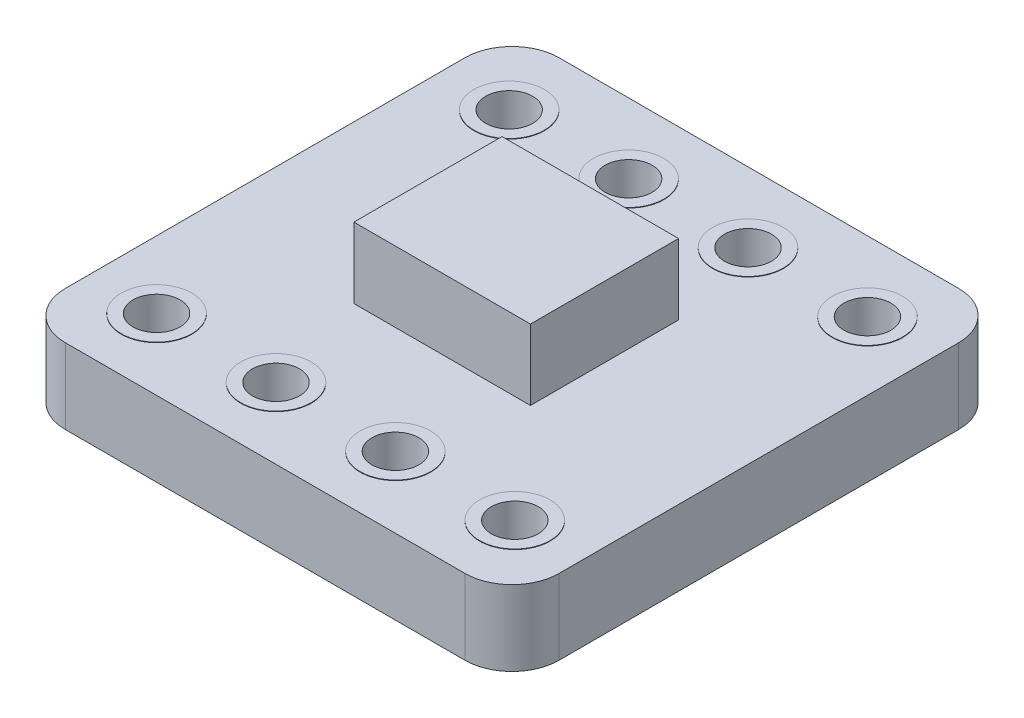
ISO-10303-21;
HEADER;
FILE_DESCRIPTION(('STEP AP214'),'2;1');
FILE_NAME('part.step','',(''),(''),'','','');
FILE_SCHEMA(('AUTOMOTIVE_DESIGN { 1 0 10303 214 1 1 1 1 }'));
ENDSEC;
DATA;
#1=APPLICATION_CONTEXT('core data for automotive mechanical design processes');
#2=APPLICATION_PROTOCOL_DEFINITION('international standard','automotive_design',2000,#1);
#3=PRODUCT_CONTEXT('',#1,'mechanical');
#4=PRODUCT('Part','Part','',(#3));
#5=PRODUCT_RELATED_PRODUCT_CATEGORY('part','',(#4));
#6=PRODUCT_DEFINITION_FORMATION('','',#4);
#7=PRODUCT_DEFINITION_CONTEXT('part definition',#1,'design');
#8=PRODUCT_DEFINITION('design','',#6,#7);
#9=PRODUCT_DEFINITION_SHAPE('','',#8);
#10=(LENGTH_UNIT() NAMED_UNIT(*) SI_UNIT(.MILLI.,.METRE.));
#11=(NAMED_UNIT(*) PLANE_ANGLE_UNIT() SI_UNIT($,.RADIAN.));
#12=(NAMED_UNIT(*) SI_UNIT($,.STERADIAN.) SOLID_ANGLE_UNIT());
#13=UNCERTAINTY_MEASURE_WITH_UNIT(LENGTH_MEASURE(1.E-05),#10,'distance_accuracy_value','');
#14=(GEOMETRIC_REPRESENTATION_CONTEXT(3) GLOBAL_UNCERTAINTY_ASSIGNED_CONTEXT((#13)) GLOBAL_UNIT_ASSIGNED_CONTEXT((#10,
#11,#12)) REPRESENTATION_CONTEXT('',''));
#15=CARTESIAN_POINT('',(0.,0.,0.));
#16=DIRECTION('',(0.,0.,1.));
#17=DIRECTION('',(1.,0.,0.));
#18=AXIS2_PLACEMENT_3D('',#15,#16,#17);
#19=CARTESIAN_POINT('',(3.34658268722157,3.1,-6.94121200425922));
#20=DIRECTION('',(1.,0.,0.));
#21=DIRECTION('',(0.,0.,-1.));
#22=AXIS2_PLACEMENT_3D('',#19,#20,#21);
#23=PLANE('',#22);
#24=DIRECTION('',(0.,0.,1.));
#25=VECTOR('',#24,1.);
#26=CARTESIAN_POINT('',(3.34658268722157,1.6,-6.94121200425922));
#27=LINE('',#26,#25);
#28=CARTESIAN_POINT('',(3.34658268722157,1.6,-6.94121200425922));
#29=VERTEX_POINT('',#28);
#30=CARTESIAN_POINT('',(3.34658268722157,1.6,-3.79028469594357));
#31=VERTEX_POINT('',#30);
#32=EDGE_CURVE('E138',#29,#31,#27,.T.);
#33=ORIENTED_EDGE('',*,*,#32,.T.);
#34=DIRECTION('',(0.,-1.,0.));
#35=VECTOR('',#34,1.);
#36=CARTESIAN_POINT('',(3.34658268722157,3.1,-3.79028469594357));
#37=LINE('',#36,#35);
#38=CARTESIAN_POINT('',(3.34658268722157,3.1,-3.79028469594357));
#39=VERTEX_POINT('',#38);
#40=EDGE_CURVE('E13',#39,#31,#37,.T.);
#41=ORIENTED_EDGE('',*,*,#40,.F.);
#42=DIRECTION('',(0.,0.,1.));
#43=VECTOR('',#42,1.);
#44=CARTESIAN_POINT('',(3.34658268722157,3.1,-6.94121200425922));
#45=LINE('',#44,#43);
#46=CARTESIAN_POINT('',(3.34658268722157,3.1,-6.94121200425922));
#47=VERTEX_POINT('',#46);
#48=EDGE_CURVE('E126',#47,#39,#45,.T.);
#49=ORIENTED_EDGE('',*,*,#48,.F.);
#50=DIRECTION('',(0.,-1.,0.));
#51=VECTOR('',#50,1.);
#52=CARTESIAN_POINT('',(3.34658268722157,3.1,-6.94121200425922));
#53=LINE('',#52,#51);
#54=EDGE_CURVE('E134',#47,#29,#53,.T.);
#55=ORIENTED_EDGE('',*,*,#54,.T.);
#56=EDGE_LOOP('',(#33,#41,#49,#55));
#57=FACE_BOUND('',#56,.T.);
#58=ADVANCED_FACE('F75',(#57),#23,.F.);
#59=CARTESIAN_POINT('',(3.34658268722157,3.1,-3.79028469594357));
#60=DIRECTION('',(0.,0.,-1.));
#61=DIRECTION('',(-1.,0.,0.));
#62=AXIS2_PLACEMENT_3D('',#59,#60,#61);
#63=PLANE('',#62);
#64=DIRECTION('',(1.,0.,0.));
#65=VECTOR('',#64,1.);
#66=CARTESIAN_POINT('',(3.34658268722157,1.6,-3.79028469594357));
#67=LINE('',#66,#65);
#68=CARTESIAN_POINT('',(7.10197360162225,1.6,-3.79028469594357));
#69=VERTEX_POINT('',#68);
#70=EDGE_CURVE('E130',#31,#69,#67,.T.);
#71=ORIENTED_EDGE('',*,*,#70,.T.);
#72=DIRECTION('',(0.,-1.,0.));
#73=VECTOR('',#72,1.);
#74=CARTESIAN_POINT('',(7.10197360162225,3.1,-3.79028469594357));
#75=LINE('',#74,#73);
#76=CARTESIAN_POINT('',(7.10197360162225,3.1,-3.79028469594357));
#77=VERTEX_POINT('',#76);
#78=EDGE_CURVE('E83',#77,#69,#75,.T.);
#79=ORIENTED_EDGE('',*,*,#78,.F.);
#80=DIRECTION('',(1.,0.,0.));
#81=VECTOR('',#80,1.);
#82=CARTESIAN_POINT('',(3.34658268722157,3.1,-3.79028469594357));
#83=LINE('',#82,#81);
#84=EDGE_CURVE('E121',#39,#77,#83,.T.);
#85=ORIENTED_EDGE('',*,*,#84,.F.);
#86=ORIENTED_EDGE('',*,*,#40,.T.);
#87=EDGE_LOOP('',(#71,#79,#85,#86));
#88=FACE_BOUND('',#87,.T.);
#89=ADVANCED_FACE('F129',(#88),#63,.F.);
#90=CARTESIAN_POINT('',(7.10197360162225,3.1,-6.94121200425922));
#91=DIRECTION('',(-1.,0.,0.));
#92=DIRECTION('',(0.,0.,1.));
#93=AXIS2_PLACEMENT_3D('',#90,#91,#92);
#94=PLANE('',#93);
#95=DIRECTION('',(0.,0.,-1.));
#96=VECTOR('',#95,1.);
#97=CARTESIAN_POINT('',(7.10197360162225,1.6,-6.94121200425922));
#98=LINE('',#97,#96);
#99=CARTESIAN_POINT('',(7.10197360162225,1.6,-6.94121200425922));
#100=VERTEX_POINT('',#99);
#101=EDGE_CURVE('E108',#69,#100,#98,.T.);
#102=ORIENTED_EDGE('',*,*,#101,.T.);
#103=DIRECTION('',(0.,-1.,0.));
#104=VECTOR('',#103,1.);
#105=CARTESIAN_POINT('',(7.10197360162225,3.1,-6.94121200425922));
#106=LINE('',#105,#104);
#107=CARTESIAN_POINT('',(7.10197360162225,3.1,-6.94121200425922));
#108=VERTEX_POINT('',#107);
#109=EDGE_CURVE('E131',#108,#100,#106,.T.);
#110=ORIENTED_EDGE('',*,*,#109,.F.);
#111=DIRECTION('',(0.,0.,-1.));
#112=VECTOR('',#111,1.);
#113=CARTESIAN_POINT('',(7.10197360162225,3.1,-6.94121200425922));
#114=LINE('',#113,#112);
#115=EDGE_CURVE('E124',#77,#108,#114,.T.);
#116=ORIENTED_EDGE('',*,*,#115,.F.);
#117=ORIENTED_EDGE('',*,*,#78,.T.);
#118=EDGE_LOOP('',(#102,#110,#116,#117));
#119=FACE_BOUND('',#118,.T.);
#120=ADVANCED_FACE('F132',(#119),#94,.F.);
#121=CARTESIAN_POINT('',(3.34658268722157,3.1,-6.94121200425922));
#122=DIRECTION('',(0.,0.,1.));
#123=DIRECTION('',(1.,0.,0.));
#124=AXIS2_PLACEMENT_3D('',#121,#122,#123);
#125=PLANE('',#124);
#126=DIRECTION('',(-1.,0.,0.));
#127=VECTOR('',#126,1.);
#128=CARTESIAN_POINT('',(3.34658268722157,1.6,-6.94121200425922));
#129=LINE('',#128,#127);
#130=EDGE_CURVE('E114',#100,#29,#129,.T.);
#131=ORIENTED_EDGE('',*,*,#130,.T.);
#132=ORIENTED_EDGE('',*,*,#54,.F.);
#133=DIRECTION('',(-1.,0.,0.));
#134=VECTOR('',#133,1.);
#135=CARTESIAN_POINT('',(3.34658268722157,3.1,-6.94121200425922));
#136=LINE('',#135,#134);
#137=EDGE_CURVE('E91',#108,#47,#136,.T.);
#138=ORIENTED_EDGE('',*,*,#137,.F.);
#139=ORIENTED_EDGE('',*,*,#109,.T.);
#140=EDGE_LOOP('',(#131,#132,#138,#139));
#141=FACE_BOUND('',#140,.T.);
#142=ADVANCED_FACE('F145',(#141),#125,.F.);
#143=CARTESIAN_POINT('',(0.,3.1,0.));
#144=DIRECTION('',(0.,1.,0.));
#145=DIRECTION('',(0.,0.,1.));
#146=AXIS2_PLACEMENT_3D('',#143,#144,#145);
#147=PLANE('',#146);
#148=ORIENTED_EDGE('',*,*,#48,.T.);
#149=ORIENTED_EDGE('',*,*,#84,.T.);
#150=ORIENTED_EDGE('',*,*,#115,.T.);
#151=ORIENTED_EDGE('',*,*,#137,.T.);
#152=EDGE_LOOP('',(#148,#149,#150,#151));
#153=FACE_BOUND('',#152,.T.);
#154=ADVANCED_FACE('F122',(#153),#147,.T.);
#155=CARTESIAN_POINT('',(0.,1.6,0.));
#156=DIRECTION('',(0.,1.,0.));
#157=DIRECTION('',(0.,0.,1.));
#158=AXIS2_PLACEMENT_3D('',#155,#156,#157);
#159=PLANE('',#158);
#160=ORIENTED_EDGE('',*,*,#32,.F.);
#161=ORIENTED_EDGE('',*,*,#130,.F.);
#162=ORIENTED_EDGE('',*,*,#101,.F.);
#163=ORIENTED_EDGE('',*,*,#70,.F.);
#164=EDGE_LOOP('',(#160,#161,#162,#163));
#165=FACE_BOUND('',#164,.T.);
#166=ADVANCED_FACE('F148',(#165),#159,.F.);
#167=CLOSED_SHELL('',(#58,#89,#120,#142,#154,#166));
#168=MANIFOLD_SOLID_BREP('B2',#167);
#169=CARTESIAN_POINT('',(0.,1.6,0.));
#170=DIRECTION('',(1.,0.,0.));
#171=DIRECTION('',(0.,0.,-1.));
#172=AXIS2_PLACEMENT_3D('',#169,#170,#171);
#173=PLANE('',#172);
#174=DIRECTION('',(0.,0.,1.));
#175=VECTOR('',#174,1.);
#176=CARTESIAN_POINT('',(0.,1.6,0.));
#177=LINE('',#176,#175);
#178=CARTESIAN_POINT('',(0.,1.6,-9.5));
#179=VERTEX_POINT('',#178);
#180=CARTESIAN_POINT('',(0.,1.6,-0.999999999999999));
#181=VERTEX_POINT('',#180);
#182=EDGE_CURVE('E298',#179,#181,#177,.T.);
#183=ORIENTED_EDGE('',*,*,#182,.F.);
#184=DIRECTION('',(0.,-1.,0.));
#185=VECTOR('',#184,1.);
#186=CARTESIAN_POINT('',(0.,1.6,-9.5));
#187=LINE('',#186,#185);
#188=CARTESIAN_POINT('',(0.,0.,-9.5));
#189=VERTEX_POINT('',#188);
#190=EDGE_CURVE('E337',#179,#189,#187,.T.);
#191=ORIENTED_EDGE('',*,*,#190,.T.);
#192=DIRECTION('',(0.,0.,1.));
#193=VECTOR('',#192,1.);
#194=CARTESIAN_POINT('',(0.,0.,0.));
#195=LINE('',#194,#193);
#196=CARTESIAN_POINT('',(0.,0.,-0.999999999999999));
#197=VERTEX_POINT('',#196);
#198=EDGE_CURVE('E470',#189,#197,#195,.T.);
#199=ORIENTED_EDGE('',*,*,#198,.T.);
#200=DIRECTION('',(0.,-1.,0.));
#201=VECTOR('',#200,1.);
#202=CARTESIAN_POINT('',(0.,1.6,-1.));
#203=LINE('',#202,#201);
#204=EDGE_CURVE('E334',#197,#181,#203,.F.);
#205=ORIENTED_EDGE('',*,*,#204,.T.);
#206=EDGE_LOOP('',(#183,#191,#199,#205));
#207=FACE_BOUND('',#206,.T.);
#208=ADVANCED_FACE('F199',(#207),#173,.F.);
#209=CARTESIAN_POINT('',(0.,1.6,0.));
#210=DIRECTION('',(0.,0.,-1.));
#211=DIRECTION('',(-1.,0.,0.));
#212=AXIS2_PLACEMENT_3D('',#209,#210,#211);
#213=PLANE('',#212);
#214=DIRECTION('',(1.,0.,0.));
#215=VECTOR('',#214,1.);
#216=CARTESIAN_POINT('',(0.,1.6,0.));
#217=LINE('',#216,#215);
#218=CARTESIAN_POINT('',(0.999999999999999,1.6,0.));
#219=VERTEX_POINT('',#218);
#220=CARTESIAN_POINT('',(9.5,1.6,0.));
#221=VERTEX_POINT('',#220);
#222=EDGE_CURVE('E303',#219,#221,#217,.T.);
#223=ORIENTED_EDGE('',*,*,#222,.F.);
#224=DIRECTION('',(0.,-1.,0.));
#225=VECTOR('',#224,1.);
#226=CARTESIAN_POINT('',(1.,1.6,0.));
#227=LINE('',#226,#225);
#228=CARTESIAN_POINT('',(0.999999999999999,0.,0.));
#229=VERTEX_POINT('',#228);
#230=EDGE_CURVE('E343',#219,#229,#227,.T.);
#231=ORIENTED_EDGE('',*,*,#230,.T.);
#232=DIRECTION('',(1.,0.,0.));
#233=VECTOR('',#232,1.);
#234=CARTESIAN_POINT('',(0.,0.,0.));
#235=LINE('',#234,#233);
#236=CARTESIAN_POINT('',(9.5,0.,0.));
#237=VERTEX_POINT('',#236);
#238=EDGE_CURVE('E305',#229,#237,#235,.T.);
#239=ORIENTED_EDGE('',*,*,#238,.T.);
#240=DIRECTION('',(0.,-1.,0.));
#241=VECTOR('',#240,1.);
#242=CARTESIAN_POINT('',(9.5,1.6,0.));
#243=LINE('',#242,#241);
#244=EDGE_CURVE('E217',#237,#221,#243,.F.);
#245=ORIENTED_EDGE('',*,*,#244,.T.);
#246=EDGE_LOOP('',(#223,#231,#239,#245));
#247=FACE_BOUND('',#246,.T.);
#248=ADVANCED_FACE('F486',(#247),#213,.F.);
#249=CARTESIAN_POINT('',(10.5,1.6,0.));
#250=DIRECTION('',(-1.,0.,0.));
#251=DIRECTION('',(0.,0.,1.));
#252=AXIS2_PLACEMENT_3D('',#249,#250,#251);
#253=PLANE('',#252);
#254=DIRECTION('',(0.,0.,-1.));
#255=VECTOR('',#254,1.);
#256=CARTESIAN_POINT('',(10.5,0.,0.));
#257=LINE('',#256,#255);
#258=CARTESIAN_POINT('',(10.5,0.,-0.999999999999999));
#259=VERTEX_POINT('',#258);
#260=CARTESIAN_POINT('',(10.5,0.,-9.5));
#261=VERTEX_POINT('',#260);
#262=EDGE_CURVE('E299',#259,#261,#257,.T.);
#263=ORIENTED_EDGE('',*,*,#262,.T.);
#264=DIRECTION('',(0.,-1.,0.));
#265=VECTOR('',#264,1.);
#266=CARTESIAN_POINT('',(10.5,1.6,-9.5));
#267=LINE('',#266,#265);
#268=CARTESIAN_POINT('',(10.5,1.6,-9.5));
#269=VERTEX_POINT('',#268);
#270=EDGE_CURVE('E274',#261,#269,#267,.F.);
#271=ORIENTED_EDGE('',*,*,#270,.T.);
#272=DIRECTION('',(0.,0.,-1.));
#273=VECTOR('',#272,1.);
#274=CARTESIAN_POINT('',(10.5,1.6,0.));
#275=LINE('',#274,#273);
#276=CARTESIAN_POINT('',(10.5,1.6,-0.999999999999999));
#277=VERTEX_POINT('',#276);
#278=EDGE_CURVE('E476',#277,#269,#275,.T.);
#279=ORIENTED_EDGE('',*,*,#278,.F.);
#280=DIRECTION('',(0.,-1.,0.));
#281=VECTOR('',#280,1.);
#282=CARTESIAN_POINT('',(10.5,1.6,-1.));
#283=LINE('',#282,#281);
#284=EDGE_CURVE('E280',#277,#259,#283,.T.);
#285=ORIENTED_EDGE('',*,*,#284,.T.);
#286=EDGE_LOOP('',(#263,#271,#279,#285));
#287=FACE_BOUND('',#286,.T.);
#288=ADVANCED_FACE('F494',(#287),#253,.F.);
#289=CARTESIAN_POINT('',(0.,1.6,-10.5));
#290=DIRECTION('',(0.,0.,1.));
#291=DIRECTION('',(1.,0.,0.));
#292=AXIS2_PLACEMENT_3D('',#289,#290,#291);
#293=PLANE('',#292);
#294=DIRECTION('',(-1.,0.,0.));
#295=VECTOR('',#294,1.);
#296=CARTESIAN_POINT('',(0.,1.6,-10.5));
#297=LINE('',#296,#295);
#298=CARTESIAN_POINT('',(9.5,1.6,-10.5));
#299=VERTEX_POINT('',#298);
#300=CARTESIAN_POINT('',(0.999999999999999,1.6,-10.5));
#301=VERTEX_POINT('',#300);
#302=EDGE_CURVE('E290',#299,#301,#297,.T.);
#303=ORIENTED_EDGE('',*,*,#302,.F.);
#304=DIRECTION('',(0.,-1.,0.));
#305=VECTOR('',#304,1.);
#306=CARTESIAN_POINT('',(9.5,1.6,-10.5));
#307=LINE('',#306,#305);
#308=CARTESIAN_POINT('',(9.5,0.,-10.5));
#309=VERTEX_POINT('',#308);
#310=EDGE_CURVE('E273',#299,#309,#307,.T.);
#311=ORIENTED_EDGE('',*,*,#310,.T.);
#312=DIRECTION('',(-1.,0.,0.));
#313=VECTOR('',#312,1.);
#314=CARTESIAN_POINT('',(0.,0.,-10.5));
#315=LINE('',#314,#313);
#316=CARTESIAN_POINT('',(0.999999999999999,0.,-10.5));
#317=VERTEX_POINT('',#316);
#318=EDGE_CURVE('E287',#309,#317,#315,.T.);
#319=ORIENTED_EDGE('',*,*,#318,.T.);
#320=DIRECTION('',(0.,-1.,0.));
#321=VECTOR('',#320,1.);
#322=CARTESIAN_POINT('',(1.,1.6,-10.5));
#323=LINE('',#322,#321);
#324=EDGE_CURVE('E293',#317,#301,#323,.F.);
#325=ORIENTED_EDGE('',*,*,#324,.T.);
#326=EDGE_LOOP('',(#303,#311,#319,#325));
#327=FACE_BOUND('',#326,.T.);
#328=ADVANCED_FACE('F286',(#327),#293,.F.);
#329=CARTESIAN_POINT('',(0.,1.6,0.));
#330=DIRECTION('',(0.,-1.,0.));
#331=DIRECTION('',(0.,0.,-1.));
#332=AXIS2_PLACEMENT_3D('',#329,#330,#331);
#333=PLANE('',#332);
#334=CARTESIAN_POINT('',(1.44,1.6,-9.));
#335=DIRECTION('',(0.,-1.,0.));
#336=DIRECTION('',(0.,0.,-1.));
#337=AXIS2_PLACEMENT_3D('',#334,#335,#336);
#338=CIRCLE('',#337,0.75);
#339=CARTESIAN_POINT('',(1.44,1.6,-9.75));
#340=VERTEX_POINT('',#339);
#341=EDGE_CURVE('E393',#340,#340,#338,.T.);
#342=ORIENTED_EDGE('',*,*,#341,.T.);
#343=EDGE_LOOP('',(#342));
#344=FACE_BOUND('',#343,.T.);
#345=CARTESIAN_POINT('',(9.06,1.6,-9.));
#346=DIRECTION('',(0.,-1.,0.));
#347=DIRECTION('',(0.,0.,-1.));
#348=AXIS2_PLACEMENT_3D('',#345,#346,#347);
#349=CIRCLE('',#348,0.75);
#350=CARTESIAN_POINT('',(9.06,1.6,-9.75));
#351=VERTEX_POINT('',#350);
#352=EDGE_CURVE('E406',#351,#351,#349,.T.);
#353=ORIENTED_EDGE('',*,*,#352,.T.);
#354=EDGE_LOOP('',(#353));
#355=FACE_BOUND('',#354,.T.);
#356=CARTESIAN_POINT('',(9.06,1.6,-1.5));
#357=DIRECTION('',(0.,-1.,0.));
#358=DIRECTION('',(0.,0.,-1.));
#359=AXIS2_PLACEMENT_3D('',#356,#357,#358);
#360=CIRCLE('',#359,0.75);
#361=CARTESIAN_POINT('',(9.06,1.6,-2.25));
#362=VERTEX_POINT('',#361);
#363=EDGE_CURVE('E73',#362,#362,#360,.F.);
#364=ORIENTED_EDGE('',*,*,#363,.F.);
#365=EDGE_LOOP('',(#364));
#366=FACE_BOUND('',#365,.T.);
#367=CARTESIAN_POINT('',(6.52,1.6,-1.5));
#368=DIRECTION('',(0.,-1.,0.));
#369=DIRECTION('',(0.,0.,-1.));
#370=AXIS2_PLACEMENT_3D('',#367,#368,#369);
#371=CIRCLE('',#370,0.749999999999999);
#372=CARTESIAN_POINT('',(6.52,1.6,-2.25));
#373=VERTEX_POINT('',#372);
#374=EDGE_CURVE('E209',#373,#373,#371,.F.);
#375=ORIENTED_EDGE('',*,*,#374,.F.);
#376=EDGE_LOOP('',(#375));
#377=FACE_BOUND('',#376,.T.);
#378=CARTESIAN_POINT('',(3.98,1.6,-1.5));
#379=DIRECTION('',(0.,-1.,0.));
#380=DIRECTION('',(0.,0.,-1.));
#381=AXIS2_PLACEMENT_3D('',#378,#379,#380);
#382=CIRCLE('',#381,0.75);
#383=CARTESIAN_POINT('',(3.98,1.6,-2.25));
#384=VERTEX_POINT('',#383);
#385=EDGE_CURVE('E351',#384,#384,#382,.F.);
#386=ORIENTED_EDGE('',*,*,#385,.F.);
#387=EDGE_LOOP('',(#386));
#388=FACE_BOUND('',#387,.T.);
#389=CARTESIAN_POINT('',(1.44,1.6,-1.5));
#390=DIRECTION('',(0.,-1.,0.));
#391=DIRECTION('',(0.,0.,-1.));
#392=AXIS2_PLACEMENT_3D('',#389,#390,#391);
#393=CIRCLE('',#392,0.75);
#394=CARTESIAN_POINT('',(1.44,1.6,-2.25));
#395=VERTEX_POINT('',#394);
#396=EDGE_CURVE('E347',#395,#395,#393,.F.);
#397=ORIENTED_EDGE('',*,*,#396,.F.);
#398=EDGE_LOOP('',(#397));
#399=FACE_BOUND('',#398,.T.);
#400=CARTESIAN_POINT('',(3.98,1.6,-9.));
#401=DIRECTION('',(0.,1.,0.));
#402=DIRECTION('',(0.,0.,1.));
#403=AXIS2_PLACEMENT_3D('',#400,#401,#402);
#404=CIRCLE('',#403,0.75);
#405=CARTESIAN_POINT('',(3.98,1.6,-8.25));
#406=VERTEX_POINT('',#405);
#407=EDGE_CURVE('E450',#406,#406,#404,.F.);
#408=ORIENTED_EDGE('',*,*,#407,.T.);
#409=EDGE_LOOP('',(#408));
#410=FACE_BOUND('',#409,.T.);
#411=CARTESIAN_POINT('',(6.52,1.6,-9.));
#412=DIRECTION('',(0.,1.,0.));
#413=DIRECTION('',(0.,0.,1.));
#414=AXIS2_PLACEMENT_3D('',#411,#412,#413);
#415=CIRCLE('',#414,0.75);
#416=CARTESIAN_POINT('',(6.52,1.6,-8.25));
#417=VERTEX_POINT('',#416);
#418=EDGE_CURVE('E454',#417,#417,#415,.F.);
#419=ORIENTED_EDGE('',*,*,#418,.T.);
#420=EDGE_LOOP('',(#419));
#421=FACE_BOUND('',#420,.T.);
#422=ORIENTED_EDGE('',*,*,#278,.T.);
#423=CARTESIAN_POINT('',(9.5,1.6,-9.5));
#424=DIRECTION('',(0.,-1.,0.));
#425=DIRECTION('',(0.,0.,-1.));
#426=AXIS2_PLACEMENT_3D('',#423,#424,#425);
#427=CIRCLE('',#426,1.);
#428=EDGE_CURVE('E331',#269,#299,#427,.F.);
#429=ORIENTED_EDGE('',*,*,#428,.T.);
#430=ORIENTED_EDGE('',*,*,#302,.T.);
#431=CARTESIAN_POINT('',(1.,1.6,-9.5));
#432=DIRECTION('',(0.,-1.,0.));
#433=DIRECTION('',(0.,0.,-1.));
#434=AXIS2_PLACEMENT_3D('',#431,#432,#433);
#435=CIRCLE('',#434,1.);
#436=EDGE_CURVE('E328',#301,#179,#435,.F.);
#437=ORIENTED_EDGE('',*,*,#436,.T.);
#438=ORIENTED_EDGE('',*,*,#182,.T.);
#439=CARTESIAN_POINT('',(1.,1.6,-1.));
#440=DIRECTION('',(0.,-1.,0.));
#441=DIRECTION('',(0.,0.,-1.));
#442=AXIS2_PLACEMENT_3D('',#439,#440,#441);
#443=CIRCLE('',#442,1.);
#444=EDGE_CURVE('E224',#181,#219,#443,.F.);
#445=ORIENTED_EDGE('',*,*,#444,.T.);
#446=ORIENTED_EDGE('',*,*,#222,.T.);
#447=CARTESIAN_POINT('',(9.5,1.6,-1.));
#448=DIRECTION('',(0.,-1.,0.));
#449=DIRECTION('',(0.,0.,-1.));
#450=AXIS2_PLACEMENT_3D('',#447,#448,#449);
#451=CIRCLE('',#450,1.);
#452=EDGE_CURVE('E323',#221,#277,#451,.F.);
#453=ORIENTED_EDGE('',*,*,#452,.T.);
#454=EDGE_LOOP('',(#422,#429,#430,#437,#438,#445,#446,#453));
#455=FACE_BOUND('',#454,.T.);
#456=ADVANCED_FACE('F492',(#344,#355,#366,#377,#388,#399,#410,#421,#455),#333,.F.);
#457=CARTESIAN_POINT('',(0.,0.,0.));
#458=DIRECTION('',(0.,-1.,0.));
#459=DIRECTION('',(0.,0.,-1.));
#460=AXIS2_PLACEMENT_3D('',#457,#458,#459);
#461=PLANE('',#460);
#462=CARTESIAN_POINT('',(6.52,0.,-1.5));
#463=DIRECTION('',(0.,-1.,0.));
#464=DIRECTION('',(0.,0.,-1.));
#465=AXIS2_PLACEMENT_3D('',#462,#463,#464);
#466=CIRCLE('',#465,0.5);
#467=CARTESIAN_POINT('',(6.52,0.,-2.));
#468=VERTEX_POINT('',#467);
#469=EDGE_CURVE('E203',#468,#468,#466,.T.);
#470=ORIENTED_EDGE('',*,*,#469,.F.);
#471=EDGE_LOOP('',(#470));
#472=FACE_BOUND('',#471,.T.);
#473=CARTESIAN_POINT('',(3.98,0.,-1.5));
#474=DIRECTION('',(0.,-1.,0.));
#475=DIRECTION('',(0.,0.,-1.));
#476=AXIS2_PLACEMENT_3D('',#473,#474,#475);
#477=CIRCLE('',#476,0.500000000000001);
#478=CARTESIAN_POINT('',(3.98,0.,-2.));
#479=VERTEX_POINT('',#478);
#480=EDGE_CURVE('E381',#479,#479,#477,.T.);
#481=ORIENTED_EDGE('',*,*,#480,.F.);
#482=EDGE_LOOP('',(#481));
#483=FACE_BOUND('',#482,.T.);
#484=CARTESIAN_POINT('',(1.44,0.,-1.5));
#485=DIRECTION('',(0.,-1.,0.));
#486=DIRECTION('',(0.,0.,-1.));
#487=AXIS2_PLACEMENT_3D('',#484,#485,#486);
#488=CIRCLE('',#487,0.5);
#489=CARTESIAN_POINT('',(1.44,0.,-2.));
#490=VERTEX_POINT('',#489);
#491=EDGE_CURVE('E378',#490,#490,#488,.T.);
#492=ORIENTED_EDGE('',*,*,#491,.F.);
#493=EDGE_LOOP('',(#492));
#494=FACE_BOUND('',#493,.T.);
#495=CARTESIAN_POINT('',(1.44,0.,-9.));
#496=DIRECTION('',(0.,-1.,0.));
#497=DIRECTION('',(0.,0.,-1.));
#498=AXIS2_PLACEMENT_3D('',#495,#496,#497);
#499=CIRCLE('',#498,0.5);
#500=CARTESIAN_POINT('',(1.44,0.,-9.5));
#501=VERTEX_POINT('',#500);
#502=EDGE_CURVE('E374',#501,#501,#499,.T.);
#503=ORIENTED_EDGE('',*,*,#502,.F.);
#504=EDGE_LOOP('',(#503));
#505=FACE_BOUND('',#504,.T.);
#506=CARTESIAN_POINT('',(3.98,0.,-9.));
#507=DIRECTION('',(0.,-1.,0.));
#508=DIRECTION('',(0.,0.,-1.));
#509=AXIS2_PLACEMENT_3D('',#506,#507,#508);
#510=CIRCLE('',#509,0.500000000000001);
#511=CARTESIAN_POINT('',(3.98,0.,-9.5));
#512=VERTEX_POINT('',#511);
#513=EDGE_CURVE('E370',#512,#512,#510,.T.);
#514=ORIENTED_EDGE('',*,*,#513,.F.);
#515=EDGE_LOOP('',(#514));
#516=FACE_BOUND('',#515,.T.);
#517=CARTESIAN_POINT('',(6.52,0.,-9.));
#518=DIRECTION('',(0.,-1.,0.));
#519=DIRECTION('',(0.,0.,-1.));
#520=AXIS2_PLACEMENT_3D('',#517,#518,#519);
#521=CIRCLE('',#520,0.500000000000002);
#522=CARTESIAN_POINT('',(6.52,0.,-9.5));
#523=VERTEX_POINT('',#522);
#524=EDGE_CURVE('E366',#523,#523,#521,.T.);
#525=ORIENTED_EDGE('',*,*,#524,.F.);
#526=EDGE_LOOP('',(#525));
#527=FACE_BOUND('',#526,.T.);
#528=CARTESIAN_POINT('',(9.06,0.,-9.));
#529=DIRECTION('',(0.,-1.,0.));
#530=DIRECTION('',(0.,0.,-1.));
#531=AXIS2_PLACEMENT_3D('',#528,#529,#530);
#532=CIRCLE('',#531,0.500000000000001);
#533=CARTESIAN_POINT('',(9.06,0.,-9.5));
#534=VERTEX_POINT('',#533);
#535=EDGE_CURVE('E362',#534,#534,#532,.T.);
#536=ORIENTED_EDGE('',*,*,#535,.F.);
#537=EDGE_LOOP('',(#536));
#538=FACE_BOUND('',#537,.T.);
#539=CARTESIAN_POINT('',(9.06,0.,-1.5));
#540=DIRECTION('',(0.,-1.,0.));
#541=DIRECTION('',(0.,0.,-1.));
#542=AXIS2_PLACEMENT_3D('',#539,#540,#541);
#543=CIRCLE('',#542,0.500000000000001);
#544=CARTESIAN_POINT('',(9.06,0.,-2.));
#545=VERTEX_POINT('',#544);
#546=EDGE_CURVE('E358',#545,#545,#543,.T.);
#547=ORIENTED_EDGE('',*,*,#546,.F.);
#548=EDGE_LOOP('',(#547));
#549=FACE_BOUND('',#548,.T.);
#550=ORIENTED_EDGE('',*,*,#318,.F.);
#551=CARTESIAN_POINT('',(9.5,0.,-9.5));
#552=DIRECTION('',(0.,-1.,0.));
#553=DIRECTION('',(0.,0.,-1.));
#554=AXIS2_PLACEMENT_3D('',#551,#552,#553);
#555=CIRCLE('',#554,1.);
#556=EDGE_CURVE('E269',#309,#261,#555,.T.);
#557=ORIENTED_EDGE('',*,*,#556,.T.);
#558=ORIENTED_EDGE('',*,*,#262,.F.);
#559=CARTESIAN_POINT('',(9.5,0.,-1.));
#560=DIRECTION('',(0.,-1.,0.));
#561=DIRECTION('',(0.,0.,-1.));
#562=AXIS2_PLACEMENT_3D('',#559,#560,#561);
#563=CIRCLE('',#562,1.);
#564=EDGE_CURVE('E292',#259,#237,#563,.T.);
#565=ORIENTED_EDGE('',*,*,#564,.T.);
#566=ORIENTED_EDGE('',*,*,#238,.F.);
#567=CARTESIAN_POINT('',(1.,0.,-1.));
#568=DIRECTION('',(0.,-1.,0.));
#569=DIRECTION('',(0.,0.,-1.));
#570=AXIS2_PLACEMENT_3D('',#567,#568,#569);
#571=CIRCLE('',#570,1.);
#572=EDGE_CURVE('E313',#229,#197,#571,.T.);
#573=ORIENTED_EDGE('',*,*,#572,.T.);
#574=ORIENTED_EDGE('',*,*,#198,.F.);
#575=CARTESIAN_POINT('',(1.,0.,-9.5));
#576=DIRECTION('',(0.,-1.,0.));
#577=DIRECTION('',(0.,0.,-1.));
#578=AXIS2_PLACEMENT_3D('',#575,#576,#577);
#579=CIRCLE('',#578,1.);
#580=EDGE_CURVE('E281',#189,#317,#579,.T.);
#581=ORIENTED_EDGE('',*,*,#580,.T.);
#582=EDGE_LOOP('',(#550,#557,#558,#565,#566,#573,#574,#581));
#583=FACE_BOUND('',#582,.T.);
#584=ADVANCED_FACE('F295',(#472,#483,#494,#505,#516,#527,#538,#549,#583),#461,.T.);
#585=CARTESIAN_POINT('',(9.5,1.6,-9.5));
#586=DIRECTION('',(0.,-1.,0.));
#587=DIRECTION('',(0.,0.,-1.));
#588=AXIS2_PLACEMENT_3D('',#585,#586,#587);
#589=CYLINDRICAL_SURFACE('',#588,1.);
#590=ORIENTED_EDGE('',*,*,#428,.F.);
#591=ORIENTED_EDGE('',*,*,#270,.F.);
#592=ORIENTED_EDGE('',*,*,#556,.F.);
#593=ORIENTED_EDGE('',*,*,#310,.F.);
#594=EDGE_LOOP('',(#590,#591,#592,#593));
#595=FACE_BOUND('',#594,.T.);
#596=ADVANCED_FACE('F272',(#595),#589,.T.);
#597=CARTESIAN_POINT('',(1.,1.6,-9.5));
#598=DIRECTION('',(0.,-1.,0.));
#599=DIRECTION('',(0.,0.,-1.));
#600=AXIS2_PLACEMENT_3D('',#597,#598,#599);
#601=CYLINDRICAL_SURFACE('',#600,1.);
#602=ORIENTED_EDGE('',*,*,#436,.F.);
#603=ORIENTED_EDGE('',*,*,#324,.F.);
#604=ORIENTED_EDGE('',*,*,#580,.F.);
#605=ORIENTED_EDGE('',*,*,#190,.F.);
#606=EDGE_LOOP('',(#602,#603,#604,#605));
#607=FACE_BOUND('',#606,.T.);
#608=ADVANCED_FACE('F512',(#607),#601,.T.);
#609=CARTESIAN_POINT('',(1.,1.6,-1.));
#610=DIRECTION('',(0.,-1.,0.));
#611=DIRECTION('',(0.,0.,-1.));
#612=AXIS2_PLACEMENT_3D('',#609,#610,#611);
#613=CYLINDRICAL_SURFACE('',#612,1.);
#614=ORIENTED_EDGE('',*,*,#444,.F.);
#615=ORIENTED_EDGE('',*,*,#204,.F.);
#616=ORIENTED_EDGE('',*,*,#572,.F.);
#617=ORIENTED_EDGE('',*,*,#230,.F.);
#618=EDGE_LOOP('',(#614,#615,#616,#617));
#619=FACE_BOUND('',#618,.T.);
#620=ADVANCED_FACE('F514',(#619),#613,.T.);
#621=CARTESIAN_POINT('',(9.5,1.6,-1.));
#622=DIRECTION('',(0.,-1.,0.));
#623=DIRECTION('',(0.,0.,-1.));
#624=AXIS2_PLACEMENT_3D('',#621,#622,#623);
#625=CYLINDRICAL_SURFACE('',#624,1.);
#626=ORIENTED_EDGE('',*,*,#452,.F.);
#627=ORIENTED_EDGE('',*,*,#244,.F.);
#628=ORIENTED_EDGE('',*,*,#564,.F.);
#629=ORIENTED_EDGE('',*,*,#284,.F.);
#630=EDGE_LOOP('',(#626,#627,#628,#629));
#631=FACE_BOUND('',#630,.T.);
#632=ADVANCED_FACE('F201',(#631),#625,.T.);
#633=CARTESIAN_POINT('',(6.52,1.61,-9.));
#634=DIRECTION('',(0.,-1.,0.));
#635=DIRECTION('',(0.,0.,-1.));
#636=AXIS2_PLACEMENT_3D('',#633,#634,#635);
#637=CYLINDRICAL_SURFACE('',#636,0.75);
#638=CARTESIAN_POINT('',(6.52,1.61,-9.));
#639=DIRECTION('',(0.,1.,0.));
#640=DIRECTION('',(0.,0.,1.));
#641=AXIS2_PLACEMENT_3D('',#638,#639,#640);
#642=CIRCLE('',#641,0.75);
#643=CARTESIAN_POINT('',(6.52,1.61,-8.25));
#644=VERTEX_POINT('',#643);
#645=EDGE_CURVE('E462',#644,#644,#642,.F.);
#646=ORIENTED_EDGE('',*,*,#645,.T.);
#647=EDGE_LOOP('',(#646));
#648=FACE_BOUND('',#647,.T.);
#649=ORIENTED_EDGE('',*,*,#418,.F.);
#650=EDGE_LOOP('',(#649));
#651=FACE_BOUND('',#650,.T.);
#652=ADVANCED_FACE('F521',(#648,#651),#637,.T.);
#653=CARTESIAN_POINT('',(6.52,1.61,-9.));
#654=DIRECTION('',(0.,-1.,0.));
#655=DIRECTION('',(0.,0.,-1.));
#656=AXIS2_PLACEMENT_3D('',#653,#654,#655);
#657=CYLINDRICAL_SURFACE('',#656,0.5);
#658=CARTESIAN_POINT('',(6.52,1.61,-9.));
#659=DIRECTION('',(0.,1.,0.));
#660=DIRECTION('',(0.,0.,1.));
#661=AXIS2_PLACEMENT_3D('',#658,#659,#660);
#662=CIRCLE('',#661,0.5);
#663=CARTESIAN_POINT('',(6.52,1.61,-8.5));
#664=VERTEX_POINT('',#663);
#665=EDGE_CURVE('E466',#664,#664,#662,.F.);
#666=ORIENTED_EDGE('',*,*,#665,.F.);
#667=EDGE_LOOP('',(#666));
#668=FACE_BOUND('',#667,.T.);
#669=ORIENTED_EDGE('',*,*,#524,.T.);
#670=EDGE_LOOP('',(#669));
#671=FACE_BOUND('',#670,.T.);
#672=ADVANCED_FACE('F529',(#668,#671),#657,.F.);
#673=CARTESIAN_POINT('',(0.,1.61,0.));
#674=DIRECTION('',(0.,1.,0.));
#675=DIRECTION('',(0.,0.,1.));
#676=AXIS2_PLACEMENT_3D('',#673,#674,#675);
#677=PLANE('',#676);
#678=ORIENTED_EDGE('',*,*,#645,.F.);
#679=EDGE_LOOP('',(#678));
#680=FACE_BOUND('',#679,.T.);
#681=ORIENTED_EDGE('',*,*,#665,.T.);
#682=EDGE_LOOP('',(#681));
#683=FACE_BOUND('',#682,.T.);
#684=ADVANCED_FACE('F535',(#680,#683),#677,.T.);
#685=CARTESIAN_POINT('',(3.98,1.61,-9.));
#686=DIRECTION('',(0.,-1.,0.));
#687=DIRECTION('',(0.,0.,-1.));
#688=AXIS2_PLACEMENT_3D('',#685,#686,#687);
#689=CYLINDRICAL_SURFACE('',#688,0.75);
#690=CARTESIAN_POINT('',(3.98,1.61,-9.));
#691=DIRECTION('',(0.,1.,0.));
#692=DIRECTION('',(0.,0.,1.));
#693=AXIS2_PLACEMENT_3D('',#690,#691,#692);
#694=CIRCLE('',#693,0.75);
#695=CARTESIAN_POINT('',(3.98,1.61,-8.25));
#696=VERTEX_POINT('',#695);
#697=EDGE_CURVE('E455',#696,#696,#694,.F.);
#698=ORIENTED_EDGE('',*,*,#697,.T.);
#699=EDGE_LOOP('',(#698));
#700=FACE_BOUND('',#699,.T.);
#701=ORIENTED_EDGE('',*,*,#407,.F.);
#702=EDGE_LOOP('',(#701));
#703=FACE_BOUND('',#702,.T.);
#704=ADVANCED_FACE('F619',(#700,#703),#689,.T.);
#705=CARTESIAN_POINT('',(3.98,1.61,-9.));
#706=DIRECTION('',(0.,-1.,0.));
#707=DIRECTION('',(0.,0.,-1.));
#708=AXIS2_PLACEMENT_3D('',#705,#706,#707);
#709=CYLINDRICAL_SURFACE('',#708,0.500000000000001);
#710=CARTESIAN_POINT('',(3.98,1.61,-9.));
#711=DIRECTION('',(0.,1.,0.));
#712=DIRECTION('',(0.,0.,1.));
#713=AXIS2_PLACEMENT_3D('',#710,#711,#712);
#714=CIRCLE('',#713,0.500000000000001);
#715=CARTESIAN_POINT('',(3.98,1.61,-8.5));
#716=VERTEX_POINT('',#715);
#717=EDGE_CURVE('E449',#716,#716,#714,.F.);
#718=ORIENTED_EDGE('',*,*,#717,.F.);
#719=EDGE_LOOP('',(#718));
#720=FACE_BOUND('',#719,.T.);
#721=ORIENTED_EDGE('',*,*,#513,.T.);
#722=EDGE_LOOP('',(#721));
#723=FACE_BOUND('',#722,.T.);
#724=ADVANCED_FACE('F622',(#720,#723),#709,.F.);
#725=CARTESIAN_POINT('',(0.,1.61,0.));
#726=DIRECTION('',(0.,1.,0.));
#727=DIRECTION('',(0.,0.,1.));
#728=AXIS2_PLACEMENT_3D('',#725,#726,#727);
#729=PLANE('',#728);
#730=ORIENTED_EDGE('',*,*,#697,.F.);
#731=EDGE_LOOP('',(#730));
#732=FACE_BOUND('',#731,.T.);
#733=ORIENTED_EDGE('',*,*,#717,.T.);
#734=EDGE_LOOP('',(#733));
#735=FACE_BOUND('',#734,.T.);
#736=ADVANCED_FACE('F611',(#732,#735),#729,.T.);
#737=CARTESIAN_POINT('',(1.44,1.61,-1.5));
#738=DIRECTION('',(0.,-1.,0.));
#739=DIRECTION('',(0.,0.,-1.));
#740=AXIS2_PLACEMENT_3D('',#737,#738,#739);
#741=CYLINDRICAL_SURFACE('',#740,0.5);
#742=CARTESIAN_POINT('',(1.44,1.61,-1.5));
#743=DIRECTION('',(0.,1.,0.));
#744=DIRECTION('',(0.,0.,1.));
#745=AXIS2_PLACEMENT_3D('',#742,#743,#744);
#746=CIRCLE('',#745,0.5);
#747=CARTESIAN_POINT('',(1.44,1.61,-1.));
#748=VERTEX_POINT('',#747);
#749=EDGE_CURVE('E445',#748,#748,#746,.T.);
#750=ORIENTED_EDGE('',*,*,#749,.T.);
#751=EDGE_LOOP('',(#750));
#752=FACE_BOUND('',#751,.T.);
#753=ORIENTED_EDGE('',*,*,#491,.T.);
#754=EDGE_LOOP('',(#753));
#755=FACE_BOUND('',#754,.T.);
#756=ADVANCED_FACE('F607',(#752,#755),#741,.F.);
#757=CARTESIAN_POINT('',(1.44,1.61,-1.5));
#758=DIRECTION('',(0.,-1.,0.));
#759=DIRECTION('',(0.,0.,-1.));
#760=AXIS2_PLACEMENT_3D('',#757,#758,#759);
#761=CYLINDRICAL_SURFACE('',#760,0.75);
#762=CARTESIAN_POINT('',(1.44,1.61,-1.5));
#763=DIRECTION('',(0.,1.,0.));
#764=DIRECTION('',(0.,0.,1.));
#765=AXIS2_PLACEMENT_3D('',#762,#763,#764);
#766=CIRCLE('',#765,0.75);
#767=CARTESIAN_POINT('',(1.44,1.61,-0.75));
#768=VERTEX_POINT('',#767);
#769=EDGE_CURVE('E441',#768,#768,#766,.T.);
#770=ORIENTED_EDGE('',*,*,#769,.F.);
#771=EDGE_LOOP('',(#770));
#772=FACE_BOUND('',#771,.T.);
#773=ORIENTED_EDGE('',*,*,#396,.T.);
#774=EDGE_LOOP('',(#773));
#775=FACE_BOUND('',#774,.T.);
#776=ADVANCED_FACE('F610',(#772,#775),#761,.T.);
#777=CARTESIAN_POINT('',(0.,1.61,0.));
#778=DIRECTION('',(0.,1.,0.));
#779=DIRECTION('',(0.,0.,1.));
#780=AXIS2_PLACEMENT_3D('',#777,#778,#779);
#781=PLANE('',#780);
#782=ORIENTED_EDGE('',*,*,#749,.F.);
#783=EDGE_LOOP('',(#782));
#784=FACE_BOUND('',#783,.T.);
#785=ORIENTED_EDGE('',*,*,#769,.T.);
#786=EDGE_LOOP('',(#785));
#787=FACE_BOUND('',#786,.T.);
#788=ADVANCED_FACE('F599',(#784,#787),#781,.T.);
#789=CARTESIAN_POINT('',(3.98,1.61,-1.5));
#790=DIRECTION('',(0.,-1.,0.));
#791=DIRECTION('',(0.,0.,-1.));
#792=AXIS2_PLACEMENT_3D('',#789,#790,#791);
#793=CYLINDRICAL_SURFACE('',#792,0.500000000000001);
#794=CARTESIAN_POINT('',(3.98,1.61,-1.5));
#795=DIRECTION('',(0.,1.,0.));
#796=DIRECTION('',(0.,0.,1.));
#797=AXIS2_PLACEMENT_3D('',#794,#795,#796);
#798=CIRCLE('',#797,0.500000000000001);
#799=CARTESIAN_POINT('',(3.98,1.61,-0.999999999999999));
#800=VERTEX_POINT('',#799);
#801=EDGE_CURVE('E437',#800,#800,#798,.T.);
#802=ORIENTED_EDGE('',*,*,#801,.T.);
#803=EDGE_LOOP('',(#802));
#804=FACE_BOUND('',#803,.T.);
#805=ORIENTED_EDGE('',*,*,#480,.T.);
#806=EDGE_LOOP('',(#805));
#807=FACE_BOUND('',#806,.T.);
#808=ADVANCED_FACE('F595',(#804,#807),#793,.F.);
#809=CARTESIAN_POINT('',(3.98,1.61,-1.5));
#810=DIRECTION('',(0.,-1.,0.));
#811=DIRECTION('',(0.,0.,-1.));
#812=AXIS2_PLACEMENT_3D('',#809,#810,#811);
#813=CYLINDRICAL_SURFACE('',#812,0.75);
#814=CARTESIAN_POINT('',(3.98,1.61,-1.5));
#815=DIRECTION('',(0.,1.,0.));
#816=DIRECTION('',(0.,0.,1.));
#817=AXIS2_PLACEMENT_3D('',#814,#815,#816);
#818=CIRCLE('',#817,0.75);
#819=CARTESIAN_POINT('',(3.98,1.61,-0.75));
#820=VERTEX_POINT('',#819);
#821=EDGE_CURVE('E433',#820,#820,#818,.T.);
#822=ORIENTED_EDGE('',*,*,#821,.F.);
#823=EDGE_LOOP('',(#822));
#824=FACE_BOUND('',#823,.T.);
#825=ORIENTED_EDGE('',*,*,#385,.T.);
#826=EDGE_LOOP('',(#825));
#827=FACE_BOUND('',#826,.T.);
#828=ADVANCED_FACE('F598',(#824,#827),#813,.T.);
#829=CARTESIAN_POINT('',(0.,1.61,0.));
#830=DIRECTION('',(0.,1.,0.));
#831=DIRECTION('',(0.,0.,1.));
#832=AXIS2_PLACEMENT_3D('',#829,#830,#831);
#833=PLANE('',#832);
#834=ORIENTED_EDGE('',*,*,#801,.F.);
#835=EDGE_LOOP('',(#834));
#836=FACE_BOUND('',#835,.T.);
#837=ORIENTED_EDGE('',*,*,#821,.T.);
#838=EDGE_LOOP('',(#837));
#839=FACE_BOUND('',#838,.T.);
#840=ADVANCED_FACE('F590',(#836,#839),#833,.T.);
#841=CARTESIAN_POINT('',(6.52,1.61,-1.5));
#842=DIRECTION('',(0.,-1.,0.));
#843=DIRECTION('',(0.,0.,-1.));
#844=AXIS2_PLACEMENT_3D('',#841,#842,#843);
#845=CYLINDRICAL_SURFACE('',#844,0.5);
#846=CARTESIAN_POINT('',(6.52,1.61,-1.5));
#847=DIRECTION('',(0.,1.,0.));
#848=DIRECTION('',(0.,0.,1.));
#849=AXIS2_PLACEMENT_3D('',#846,#847,#848);
#850=CIRCLE('',#849,0.5);
#851=CARTESIAN_POINT('',(6.52,1.61,-1.));
#852=VERTEX_POINT('',#851);
#853=EDGE_CURVE('E429',#852,#852,#850,.T.);
#854=ORIENTED_EDGE('',*,*,#853,.T.);
#855=EDGE_LOOP('',(#854));
#856=FACE_BOUND('',#855,.T.);
#857=ORIENTED_EDGE('',*,*,#469,.T.);
#858=EDGE_LOOP('',(#857));
#859=FACE_BOUND('',#858,.T.);
#860=ADVANCED_FACE('F587',(#856,#859),#845,.F.);
#861=CARTESIAN_POINT('',(6.52,1.61,-1.5));
#862=DIRECTION('',(0.,-1.,0.));
#863=DIRECTION('',(0.,0.,-1.));
#864=AXIS2_PLACEMENT_3D('',#861,#862,#863);
#865=CYLINDRICAL_SURFACE('',#864,0.749999999999999);
#866=CARTESIAN_POINT('',(6.52,1.61,-1.5));
#867=DIRECTION('',(0.,1.,0.));
#868=DIRECTION('',(0.,0.,1.));
#869=AXIS2_PLACEMENT_3D('',#866,#867,#868);
#870=CIRCLE('',#869,0.749999999999999);
#871=CARTESIAN_POINT('',(6.52,1.61,-0.750000000000001));
#872=VERTEX_POINT('',#871);
#873=EDGE_CURVE('E425',#872,#872,#870,.T.);
#874=ORIENTED_EDGE('',*,*,#873,.F.);
#875=EDGE_LOOP('',(#874));
#876=FACE_BOUND('',#875,.T.);
#877=ORIENTED_EDGE('',*,*,#374,.T.);
#878=EDGE_LOOP('',(#877));
#879=FACE_BOUND('',#878,.T.);
#880=ADVANCED_FACE('F576',(#876,#879),#865,.T.);
#881=CARTESIAN_POINT('',(0.,1.61,0.));
#882=DIRECTION('',(0.,1.,0.));
#883=DIRECTION('',(0.,0.,1.));
#884=AXIS2_PLACEMENT_3D('',#881,#882,#883);
#885=PLANE('',#884);
#886=ORIENTED_EDGE('',*,*,#853,.F.);
#887=EDGE_LOOP('',(#886));
#888=FACE_BOUND('',#887,.T.);
#889=ORIENTED_EDGE('',*,*,#873,.T.);
#890=EDGE_LOOP('',(#889));
#891=FACE_BOUND('',#890,.T.);
#892=ADVANCED_FACE('F566',(#888,#891),#885,.T.);
#893=CARTESIAN_POINT('',(9.06,1.61,-1.5));
#894=DIRECTION('',(0.,-1.,0.));
#895=DIRECTION('',(0.,0.,-1.));
#896=AXIS2_PLACEMENT_3D('',#893,#894,#895);
#897=CYLINDRICAL_SURFACE('',#896,0.500000000000001);
#898=CARTESIAN_POINT('',(9.06,1.61,-1.5));
#899=DIRECTION('',(0.,1.,0.));
#900=DIRECTION('',(0.,0.,1.));
#901=AXIS2_PLACEMENT_3D('',#898,#899,#900);
#902=CIRCLE('',#901,0.500000000000001);
#903=CARTESIAN_POINT('',(9.06,1.61,-0.999999999999999));
#904=VERTEX_POINT('',#903);
#905=EDGE_CURVE('E421',#904,#904,#902,.T.);
#906=ORIENTED_EDGE('',*,*,#905,.T.);
#907=EDGE_LOOP('',(#906));
#908=FACE_BOUND('',#907,.T.);
#909=ORIENTED_EDGE('',*,*,#546,.T.);
#910=EDGE_LOOP('',(#909));
#911=FACE_BOUND('',#910,.T.);
#912=ADVANCED_FACE('F563',(#908,#911),#897,.F.);
#913=CARTESIAN_POINT('',(9.06,1.61,-1.5));
#914=DIRECTION('',(0.,-1.,0.));
#915=DIRECTION('',(0.,0.,-1.));
#916=AXIS2_PLACEMENT_3D('',#913,#914,#915);
#917=CYLINDRICAL_SURFACE('',#916,0.75);
#918=CARTESIAN_POINT('',(9.06,1.61,-1.5));
#919=DIRECTION('',(0.,1.,0.));
#920=DIRECTION('',(0.,0.,1.));
#921=AXIS2_PLACEMENT_3D('',#918,#919,#920);
#922=CIRCLE('',#921,0.75);
#923=CARTESIAN_POINT('',(9.06,1.61,-0.75));
#924=VERTEX_POINT('',#923);
#925=EDGE_CURVE('E417',#924,#924,#922,.T.);
#926=ORIENTED_EDGE('',*,*,#925,.F.);
#927=EDGE_LOOP('',(#926));
#928=FACE_BOUND('',#927,.T.);
#929=ORIENTED_EDGE('',*,*,#363,.T.);
#930=EDGE_LOOP('',(#929));
#931=FACE_BOUND('',#930,.T.);
#932=ADVANCED_FACE('F565',(#928,#931),#917,.T.);
#933=CARTESIAN_POINT('',(0.,1.61,0.));
#934=DIRECTION('',(0.,1.,0.));
#935=DIRECTION('',(0.,0.,1.));
#936=AXIS2_PLACEMENT_3D('',#933,#934,#935);
#937=PLANE('',#936);
#938=ORIENTED_EDGE('',*,*,#905,.F.);
#939=EDGE_LOOP('',(#938));
#940=FACE_BOUND('',#939,.T.);
#941=ORIENTED_EDGE('',*,*,#925,.T.);
#942=EDGE_LOOP('',(#941));
#943=FACE_BOUND('',#942,.T.);
#944=ADVANCED_FACE('F573',(#940,#943),#937,.T.);
#945=CARTESIAN_POINT('',(9.06,1.61,-9.));
#946=DIRECTION('',(0.,-1.,0.));
#947=DIRECTION('',(0.,0.,-1.));
#948=AXIS2_PLACEMENT_3D('',#945,#946,#947);
#949=CYLINDRICAL_SURFACE('',#948,0.75);
#950=CARTESIAN_POINT('',(9.06,1.61,-9.));
#951=DIRECTION('',(0.,-1.,0.));
#952=DIRECTION('',(0.,0.,-1.));
#953=AXIS2_PLACEMENT_3D('',#950,#951,#952);
#954=CIRCLE('',#953,0.75);
#955=CARTESIAN_POINT('',(9.06,1.61,-9.75));
#956=VERTEX_POINT('',#955);
#957=EDGE_CURVE('E405',#956,#956,#954,.T.);
#958=ORIENTED_EDGE('',*,*,#957,.T.);
#959=EDGE_LOOP('',(#958));
#960=FACE_BOUND('',#959,.T.);
#961=ORIENTED_EDGE('',*,*,#352,.F.);
#962=EDGE_LOOP('',(#961));
#963=FACE_BOUND('',#962,.T.);
#964=ADVANCED_FACE('F585',(#960,#963),#949,.T.);
#965=CARTESIAN_POINT('',(9.06,1.61,-9.));
#966=DIRECTION('',(0.,-1.,0.));
#967=DIRECTION('',(0.,0.,-1.));
#968=AXIS2_PLACEMENT_3D('',#965,#966,#967);
#969=PLANE('',#968);
#970=CARTESIAN_POINT('',(9.06,1.61,-9.));
#971=DIRECTION('',(0.,-1.,0.));
#972=DIRECTION('',(0.,0.,-1.));
#973=AXIS2_PLACEMENT_3D('',#970,#971,#972);
#974=CIRCLE('',#973,0.500000000000001);
#975=CARTESIAN_POINT('',(9.06,1.61,-9.5));
#976=VERTEX_POINT('',#975);
#977=EDGE_CURVE('E410',#976,#976,#974,.T.);
#978=ORIENTED_EDGE('',*,*,#977,.T.);
#979=EDGE_LOOP('',(#978));
#980=FACE_BOUND('',#979,.T.);
#981=ORIENTED_EDGE('',*,*,#957,.F.);
#982=EDGE_LOOP('',(#981));
#983=FACE_BOUND('',#982,.T.);
#984=ADVANCED_FACE('F713',(#980,#983),#969,.F.);
#985=CARTESIAN_POINT('',(9.06,1.61,-9.));
#986=DIRECTION('',(0.,-1.,0.));
#987=DIRECTION('',(0.,0.,-1.));
#988=AXIS2_PLACEMENT_3D('',#985,#986,#987);
#989=CYLINDRICAL_SURFACE('',#988,0.500000000000001);
#990=ORIENTED_EDGE('',*,*,#977,.F.);
#991=EDGE_LOOP('',(#990));
#992=FACE_BOUND('',#991,.T.);
#993=ORIENTED_EDGE('',*,*,#535,.T.);
#994=EDGE_LOOP('',(#993));
#995=FACE_BOUND('',#994,.T.);
#996=ADVANCED_FACE('F580',(#992,#995),#989,.F.);
#997=CARTESIAN_POINT('',(1.44,1.61,-9.));
#998=DIRECTION('',(0.,-1.,0.));
#999=DIRECTION('',(0.,0.,-1.));
#1000=AXIS2_PLACEMENT_3D('',#997,#998,#999);
#1001=CYLINDRICAL_SURFACE('',#1000,0.75);
#1002=CARTESIAN_POINT('',(1.44,1.61,-9.));
#1003=DIRECTION('',(0.,-1.,0.));
#1004=DIRECTION('',(0.,0.,-1.));
#1005=AXIS2_PLACEMENT_3D('',#1002,#1003,#1004);
#1006=CIRCLE('',#1005,0.75);
#1007=CARTESIAN_POINT('',(1.44,1.61,-9.75));
#1008=VERTEX_POINT('',#1007);
#1009=EDGE_CURVE('E388',#1008,#1008,#1006,.T.);
#1010=ORIENTED_EDGE('',*,*,#1009,.T.);
#1011=EDGE_LOOP('',(#1010));
#1012=FACE_BOUND('',#1011,.T.);
#1013=ORIENTED_EDGE('',*,*,#341,.F.);
#1014=EDGE_LOOP('',(#1013));
#1015=FACE_BOUND('',#1014,.T.);
#1016=ADVANCED_FACE('F731',(#1012,#1015),#1001,.T.);
#1017=CARTESIAN_POINT('',(1.44,1.61,-9.));
#1018=DIRECTION('',(0.,-1.,0.));
#1019=DIRECTION('',(0.,0.,-1.));
#1020=AXIS2_PLACEMENT_3D('',#1017,#1018,#1019);
#1021=PLANE('',#1020);
#1022=CARTESIAN_POINT('',(1.44,1.61,-9.));
#1023=DIRECTION('',(0.,1.,0.));
#1024=DIRECTION('',(0.,0.,1.));
#1025=AXIS2_PLACEMENT_3D('',#1022,#1023,#1024);
#1026=CIRCLE('',#1025,0.5);
#1027=CARTESIAN_POINT('',(1.44,1.61,-8.5));
#1028=VERTEX_POINT('',#1027);
#1029=EDGE_CURVE('E399',#1028,#1028,#1026,.F.);
#1030=ORIENTED_EDGE('',*,*,#1029,.T.);
#1031=EDGE_LOOP('',(#1030));
#1032=FACE_BOUND('',#1031,.T.);
#1033=ORIENTED_EDGE('',*,*,#1009,.F.);
#1034=EDGE_LOOP('',(#1033));
#1035=FACE_BOUND('',#1034,.T.);
#1036=ADVANCED_FACE('F740',(#1032,#1035),#1021,.F.);
#1037=CARTESIAN_POINT('',(1.44,1.61,-9.));
#1038=DIRECTION('',(0.,-1.,0.));
#1039=DIRECTION('',(0.,0.,-1.));
#1040=AXIS2_PLACEMENT_3D('',#1037,#1038,#1039);
#1041=CYLINDRICAL_SURFACE('',#1040,0.5);
#1042=ORIENTED_EDGE('',*,*,#1029,.F.);
#1043=EDGE_LOOP('',(#1042));
#1044=FACE_BOUND('',#1043,.T.);
#1045=ORIENTED_EDGE('',*,*,#502,.T.);
#1046=EDGE_LOOP('',(#1045));
#1047=FACE_BOUND('',#1046,.T.);
#1048=ADVANCED_FACE('F748',(#1044,#1047),#1041,.F.);
#1049=CLOSED_SHELL('',(#208,#248,#288,#328,#456,#584,#596,#608,#620,#632,#652,#672,#684,#704,
#724,#736,#756,#776,#788,#808,#828,#840,#860,#880,#892,#912,#932,#944,#964,#984,#996,#1016,
#1036,#1048));
#1050=MANIFOLD_SOLID_BREP('B7',#1049);
#1051=ADVANCED_BREP_SHAPE_REPRESENTATION('',(#18,#168,#1050),#14);
#1052=SHAPE_DEFINITION_REPRESENTATION(#9,#1051);
ENDSEC;
END-ISO-10303-21;
